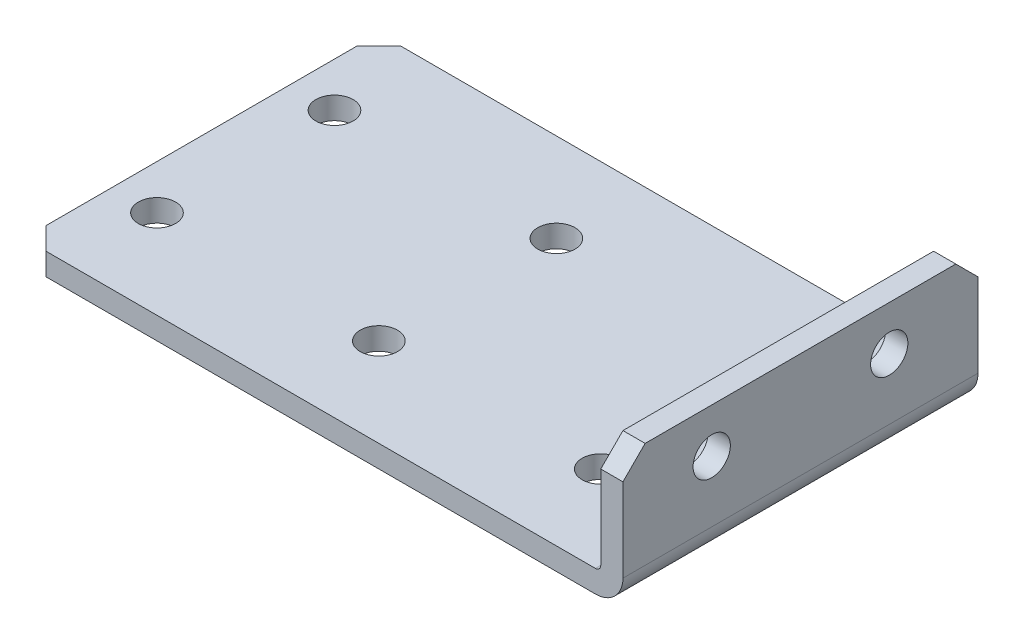
ISO-10303-21;
HEADER;
FILE_DESCRIPTION(('STEP AP214'),'2;1');
FILE_NAME('part.step','',(''),(''),'','','');
FILE_SCHEMA(('AUTOMOTIVE_DESIGN { 1 0 10303 214 1 1 1 1 }'));
ENDSEC;
DATA;
#1=APPLICATION_CONTEXT('core data for automotive mechanical design processes');
#2=APPLICATION_PROTOCOL_DEFINITION('international standard','automotive_design',2000,#1);
#3=PRODUCT_CONTEXT('',#1,'mechanical');
#4=PRODUCT('Part','Part','',(#3));
#5=PRODUCT_RELATED_PRODUCT_CATEGORY('part','',(#4));
#6=PRODUCT_DEFINITION_FORMATION('','',#4);
#7=PRODUCT_DEFINITION_CONTEXT('part definition',#1,'design');
#8=PRODUCT_DEFINITION('design','',#6,#7);
#9=PRODUCT_DEFINITION_SHAPE('','',#8);
#10=(LENGTH_UNIT() NAMED_UNIT(*) SI_UNIT(.MILLI.,.METRE.));
#11=(NAMED_UNIT(*) PLANE_ANGLE_UNIT() SI_UNIT($,.RADIAN.));
#12=(NAMED_UNIT(*) SI_UNIT($,.STERADIAN.) SOLID_ANGLE_UNIT());
#13=UNCERTAINTY_MEASURE_WITH_UNIT(LENGTH_MEASURE(1.E-05),#10,'distance_accuracy_value','');
#14=(GEOMETRIC_REPRESENTATION_CONTEXT(3) GLOBAL_UNCERTAINTY_ASSIGNED_CONTEXT((#13)) GLOBAL_UNIT_ASSIGNED_CONTEXT((#10,
#11,#12)) REPRESENTATION_CONTEXT('',''));
#15=CARTESIAN_POINT('',(0.,0.,0.));
#16=DIRECTION('',(0.,0.,1.));
#17=DIRECTION('',(1.,0.,0.));
#18=AXIS2_PLACEMENT_3D('',#15,#16,#17);
#19=CARTESIAN_POINT('',(85.7250000000001,12.7000000000001,-25.4));
#20=DIRECTION('',(-1.,0.,0.));
#21=DIRECTION('',(0.,-1.,0.));
#22=AXIS2_PLACEMENT_3D('',#19,#20,#21);
#23=CYLINDRICAL_SURFACE('',#22,2.667);
#24=CARTESIAN_POINT('',(85.7250000000001,12.7000000000001,-25.4));
#25=DIRECTION('',(-1.,0.,0.));
#26=DIRECTION('',(0.,-1.,0.));
#27=AXIS2_PLACEMENT_3D('',#24,#25,#26);
#28=CIRCLE('',#27,2.667);
#29=CARTESIAN_POINT('',(85.7250000000001,10.0330000000001,-25.4));
#30=VERTEX_POINT('',#29);
#31=EDGE_CURVE('E175',#30,#30,#28,.F.);
#32=ORIENTED_EDGE('',*,*,#31,.T.);
#33=EDGE_LOOP('',(#32));
#34=FACE_BOUND('',#33,.T.);
#35=CARTESIAN_POINT('',(82.55,12.7000000000001,-25.4));
#36=DIRECTION('',(-1.,0.,0.));
#37=DIRECTION('',(0.,-1.,0.));
#38=AXIS2_PLACEMENT_3D('',#35,#36,#37);
#39=CIRCLE('',#38,2.667);
#40=CARTESIAN_POINT('',(82.55,10.0330000000001,-25.4));
#41=VERTEX_POINT('',#40);
#42=EDGE_CURVE('E178',#41,#41,#39,.F.);
#43=ORIENTED_EDGE('',*,*,#42,.F.);
#44=EDGE_LOOP('',(#43));
#45=FACE_BOUND('',#44,.T.);
#46=ADVANCED_FACE('F14',(#34,#45),#23,.F.);
#47=CARTESIAN_POINT('',(85.7250000000001,12.7000000000001,-50.8));
#48=DIRECTION('',(-1.,0.,0.));
#49=DIRECTION('',(0.,-1.,0.));
#50=AXIS2_PLACEMENT_3D('',#47,#48,#49);
#51=CYLINDRICAL_SURFACE('',#50,2.667);
#52=CARTESIAN_POINT('',(85.7250000000001,12.7000000000001,-50.8));
#53=DIRECTION('',(-1.,0.,0.));
#54=DIRECTION('',(0.,-1.,0.));
#55=AXIS2_PLACEMENT_3D('',#52,#53,#54);
#56=CIRCLE('',#55,2.667);
#57=CARTESIAN_POINT('',(85.7250000000001,10.0330000000001,-50.8));
#58=VERTEX_POINT('',#57);
#59=EDGE_CURVE('E170',#58,#58,#56,.F.);
#60=ORIENTED_EDGE('',*,*,#59,.T.);
#61=EDGE_LOOP('',(#60));
#62=FACE_BOUND('',#61,.T.);
#63=CARTESIAN_POINT('',(82.55,12.7000000000001,-50.8));
#64=DIRECTION('',(-1.,0.,0.));
#65=DIRECTION('',(0.,-1.,0.));
#66=AXIS2_PLACEMENT_3D('',#63,#64,#65);
#67=CIRCLE('',#66,2.667);
#68=CARTESIAN_POINT('',(82.55,10.0330000000001,-50.8));
#69=VERTEX_POINT('',#68);
#70=EDGE_CURVE('E192',#69,#69,#67,.F.);
#71=ORIENTED_EDGE('',*,*,#70,.F.);
#72=EDGE_LOOP('',(#71));
#73=FACE_BOUND('',#72,.T.);
#74=ADVANCED_FACE('F244',(#62,#73),#51,.F.);
#75=CARTESIAN_POINT('',(85.7250000000001,19.05,0.));
#76=DIRECTION('',(0.,-1.,0.));
#77=DIRECTION('',(1.,0.,0.));
#78=AXIS2_PLACEMENT_3D('',#75,#76,#77);
#79=PLANE('',#78);
#80=DIRECTION('',(1.,0.,0.));
#81=VECTOR('',#80,1.);
#82=CARTESIAN_POINT('',(85.7250000000001,19.05,-60.325));
#83=LINE('',#82,#81);
#84=CARTESIAN_POINT('',(85.7250000000001,19.05,-60.325));
#85=VERTEX_POINT('',#84);
#86=CARTESIAN_POINT('',(82.5500000000001,19.05,-60.325));
#87=VERTEX_POINT('',#86);
#88=EDGE_CURVE('E187',#85,#87,#83,.F.);
#89=ORIENTED_EDGE('',*,*,#88,.T.);
#90=DIRECTION('',(0.,0.,1.));
#91=VECTOR('',#90,1.);
#92=CARTESIAN_POINT('',(82.5500000000001,19.05,0.));
#93=LINE('',#92,#91);
#94=CARTESIAN_POINT('',(82.55,19.05,-15.875));
#95=VERTEX_POINT('',#94);
#96=EDGE_CURVE('E193',#95,#87,#93,.F.);
#97=ORIENTED_EDGE('',*,*,#96,.F.);
#98=DIRECTION('',(1.,0.,0.));
#99=VECTOR('',#98,1.);
#100=CARTESIAN_POINT('',(85.7250000000001,19.05,-15.875));
#101=LINE('',#100,#99);
#102=CARTESIAN_POINT('',(85.7250000000001,19.05,-15.875));
#103=VERTEX_POINT('',#102);
#104=EDGE_CURVE('E176',#95,#103,#101,.T.);
#105=ORIENTED_EDGE('',*,*,#104,.T.);
#106=DIRECTION('',(0.,0.,1.));
#107=VECTOR('',#106,1.);
#108=CARTESIAN_POINT('',(85.7250000000001,19.05,0.));
#109=LINE('',#108,#107);
#110=EDGE_CURVE('E169',#103,#85,#109,.F.);
#111=ORIENTED_EDGE('',*,*,#110,.T.);
#112=EDGE_LOOP('',(#89,#97,#105,#111));
#113=FACE_BOUND('',#112,.T.);
#114=ADVANCED_FACE('F250',(#113),#79,.F.);
#115=CARTESIAN_POINT('',(85.7250000000001,19.05,-60.325));
#116=DIRECTION('',(0.,-0.707106781186548,0.707106781186548));
#117=DIRECTION('',(0.,-0.707106781186548,-0.707106781186548));
#118=AXIS2_PLACEMENT_3D('',#115,#116,#117);
#119=PLANE('',#118);
#120=DIRECTION('',(1.,0.,0.));
#121=VECTOR('',#120,1.);
#122=CARTESIAN_POINT('',(85.7250000000001,15.875,-63.5));
#123=LINE('',#122,#121);
#124=CARTESIAN_POINT('',(85.725,15.875,-63.5));
#125=VERTEX_POINT('',#124);
#126=CARTESIAN_POINT('',(82.55,15.875,-63.5));
#127=VERTEX_POINT('',#126);
#128=EDGE_CURVE('E109',#125,#127,#123,.F.);
#129=ORIENTED_EDGE('',*,*,#128,.T.);
#130=DIRECTION('',(0.,-0.707106781186545,-0.70710678118655));
#131=VECTOR('',#130,1.);
#132=CARTESIAN_POINT('',(82.5500000000001,19.05,-60.325));
#133=LINE('',#132,#131);
#134=EDGE_CURVE('E196',#87,#127,#133,.T.);
#135=ORIENTED_EDGE('',*,*,#134,.F.);
#136=ORIENTED_EDGE('',*,*,#88,.F.);
#137=DIRECTION('',(0.,-0.707106781186546,-0.707106781186549));
#138=VECTOR('',#137,1.);
#139=CARTESIAN_POINT('',(85.7250000000001,19.05,-60.325));
#140=LINE('',#139,#138);
#141=EDGE_CURVE('E183',#85,#125,#140,.T.);
#142=ORIENTED_EDGE('',*,*,#141,.T.);
#143=EDGE_LOOP('',(#129,#135,#136,#142));
#144=FACE_BOUND('',#143,.T.);
#145=ADVANCED_FACE('F322',(#144),#119,.F.);
#146=CARTESIAN_POINT('',(81.788,3.937,-63.5));
#147=DIRECTION('',(0.,0.,-1.));
#148=DIRECTION('',(-1.,0.,0.));
#149=AXIS2_PLACEMENT_3D('',#146,#147,#148);
#150=CYLINDRICAL_SURFACE('',#149,0.761999999999999);
#151=CARTESIAN_POINT('',(81.788,3.937,-12.7));
#152=DIRECTION('',(0.,0.,-1.));
#153=DIRECTION('',(-1.,0.,0.));
#154=AXIS2_PLACEMENT_3D('',#151,#152,#153);
#155=CIRCLE('',#154,0.761999999999999);
#156=CARTESIAN_POINT('',(82.55,3.937,-12.7));
#157=VERTEX_POINT('',#156);
#158=CARTESIAN_POINT('',(81.788,3.175,-12.7));
#159=VERTEX_POINT('',#158);
#160=EDGE_CURVE('E17',#157,#159,#155,.T.);
#161=ORIENTED_EDGE('',*,*,#160,.F.);
#162=DIRECTION('',(0.,0.,1.));
#163=VECTOR('',#162,1.);
#164=CARTESIAN_POINT('',(82.55,3.937,0.));
#165=LINE('',#164,#163);
#166=CARTESIAN_POINT('',(82.55,3.93699999999999,-63.5));
#167=VERTEX_POINT('',#166);
#168=EDGE_CURVE('E177',#167,#157,#165,.T.);
#169=ORIENTED_EDGE('',*,*,#168,.F.);
#170=CARTESIAN_POINT('',(81.788,3.937,-63.5));
#171=DIRECTION('',(0.,0.,-1.));
#172=DIRECTION('',(-1.,0.,0.));
#173=AXIS2_PLACEMENT_3D('',#170,#171,#172);
#174=CIRCLE('',#173,0.761999999999999);
#175=CARTESIAN_POINT('',(81.788,3.175,-63.5));
#176=VERTEX_POINT('',#175);
#177=EDGE_CURVE('E108',#167,#176,#174,.T.);
#178=ORIENTED_EDGE('',*,*,#177,.T.);
#179=DIRECTION('',(0.,0.,-1.));
#180=VECTOR('',#179,1.);
#181=CARTESIAN_POINT('',(81.788,3.175,-63.5));
#182=LINE('',#181,#180);
#183=EDGE_CURVE('E111',#176,#159,#182,.F.);
#184=ORIENTED_EDGE('',*,*,#183,.T.);
#185=EDGE_LOOP('',(#161,#169,#178,#184));
#186=FACE_BOUND('',#185,.T.);
#187=ADVANCED_FACE('F112',(#186),#150,.F.);
#188=CARTESIAN_POINT('',(82.5500000000001,19.05,0.));
#189=DIRECTION('',(-1.,0.,0.));
#190=DIRECTION('',(0.,-1.,0.));
#191=AXIS2_PLACEMENT_3D('',#188,#189,#190);
#192=PLANE('',#191);
#193=ORIENTED_EDGE('',*,*,#70,.T.);
#194=EDGE_LOOP('',(#193));
#195=FACE_BOUND('',#194,.T.);
#196=ORIENTED_EDGE('',*,*,#42,.T.);
#197=EDGE_LOOP('',(#196));
#198=FACE_BOUND('',#197,.T.);
#199=DIRECTION('',(0.,1.,0.));
#200=VECTOR('',#199,1.);
#201=CARTESIAN_POINT('',(82.55,0.,-12.7));
#202=LINE('',#201,#200);
#203=CARTESIAN_POINT('',(82.55,15.875,-12.7));
#204=VERTEX_POINT('',#203);
#205=EDGE_CURVE('E107',#157,#204,#202,.T.);
#206=ORIENTED_EDGE('',*,*,#205,.T.);
#207=DIRECTION('',(0.,0.707106781186549,-0.707106781186546));
#208=VECTOR('',#207,1.);
#209=CARTESIAN_POINT('',(82.55,19.05,-15.875));
#210=LINE('',#209,#208);
#211=EDGE_CURVE('E172',#204,#95,#210,.T.);
#212=ORIENTED_EDGE('',*,*,#211,.T.);
#213=ORIENTED_EDGE('',*,*,#96,.T.);
#214=ORIENTED_EDGE('',*,*,#134,.T.);
#215=DIRECTION('',(0.,-1.,0.));
#216=VECTOR('',#215,1.);
#217=CARTESIAN_POINT('',(82.5500000000001,19.05,-63.5));
#218=LINE('',#217,#216);
#219=EDGE_CURVE('E179',#127,#167,#218,.T.);
#220=ORIENTED_EDGE('',*,*,#219,.T.);
#221=ORIENTED_EDGE('',*,*,#168,.T.);
#222=EDGE_LOOP('',(#206,#212,#213,#214,#220,#221));
#223=FACE_BOUND('',#222,.T.);
#224=ADVANCED_FACE('F240',(#195,#198,#223),#192,.T.);
#225=CARTESIAN_POINT('',(85.7250000000001,19.05,-15.875));
#226=DIRECTION('',(0.,-0.707106781186546,-0.707106781186549));
#227=DIRECTION('',(0.,0.707106781186549,-0.707106781186546));
#228=AXIS2_PLACEMENT_3D('',#225,#226,#227);
#229=PLANE('',#228);
#230=DIRECTION('',(-1.,0.,0.));
#231=VECTOR('',#230,1.);
#232=CARTESIAN_POINT('',(-9.42940188980387,15.875,-12.7));
#233=LINE('',#232,#231);
#234=CARTESIAN_POINT('',(85.725,15.875,-12.7));
#235=VERTEX_POINT('',#234);
#236=EDGE_CURVE('E125',#204,#235,#233,.F.);
#237=ORIENTED_EDGE('',*,*,#236,.T.);
#238=DIRECTION('',(0.,0.707106781186549,-0.707106781186546));
#239=VECTOR('',#238,1.);
#240=CARTESIAN_POINT('',(85.725,15.875,-12.7));
#241=LINE('',#240,#239);
#242=EDGE_CURVE('E166',#235,#103,#241,.T.);
#243=ORIENTED_EDGE('',*,*,#242,.T.);
#244=ORIENTED_EDGE('',*,*,#104,.F.);
#245=ORIENTED_EDGE('',*,*,#211,.F.);
#246=EDGE_LOOP('',(#237,#243,#244,#245));
#247=FACE_BOUND('',#246,.T.);
#248=ADVANCED_FACE('F312',(#247),#229,.F.);
#249=CARTESIAN_POINT('',(85.7250000000001,19.05,0.));
#250=DIRECTION('',(-1.,0.,0.));
#251=DIRECTION('',(0.,-1.,0.));
#252=AXIS2_PLACEMENT_3D('',#249,#250,#251);
#253=PLANE('',#252);
#254=ORIENTED_EDGE('',*,*,#141,.F.);
#255=ORIENTED_EDGE('',*,*,#110,.F.);
#256=ORIENTED_EDGE('',*,*,#242,.F.);
#257=DIRECTION('',(0.,1.,0.));
#258=VECTOR('',#257,1.);
#259=CARTESIAN_POINT('',(85.725,0.,-12.7));
#260=LINE('',#259,#258);
#261=CARTESIAN_POINT('',(85.725,3.93699999999999,-12.7));
#262=VERTEX_POINT('',#261);
#263=EDGE_CURVE('E144',#235,#262,#260,.F.);
#264=ORIENTED_EDGE('',*,*,#263,.T.);
#265=DIRECTION('',(0.,0.,-1.));
#266=VECTOR('',#265,1.);
#267=CARTESIAN_POINT('',(85.725,3.93699999999999,-63.5));
#268=LINE('',#267,#266);
#269=CARTESIAN_POINT('',(85.725,3.93699999999999,-63.5));
#270=VERTEX_POINT('',#269);
#271=EDGE_CURVE('E127',#270,#262,#268,.F.);
#272=ORIENTED_EDGE('',*,*,#271,.F.);
#273=DIRECTION('',(0.,-1.,0.));
#274=VECTOR('',#273,1.);
#275=CARTESIAN_POINT('',(85.7250000000001,19.05,-63.5));
#276=LINE('',#275,#274);
#277=EDGE_CURVE('E117',#125,#270,#276,.T.);
#278=ORIENTED_EDGE('',*,*,#277,.F.);
#279=EDGE_LOOP('',(#254,#255,#256,#264,#272,#278));
#280=FACE_BOUND('',#279,.T.);
#281=ORIENTED_EDGE('',*,*,#59,.F.);
#282=EDGE_LOOP('',(#281));
#283=FACE_BOUND('',#282,.T.);
#284=ORIENTED_EDGE('',*,*,#31,.F.);
#285=EDGE_LOOP('',(#284));
#286=FACE_BOUND('',#285,.T.);
#287=ADVANCED_FACE('F309',(#280,#283,#286),#253,.F.);
#288=CARTESIAN_POINT('',(0.,3.175,-63.5));
#289=DIRECTION('',(0.,-1.,0.));
#290=DIRECTION('',(0.,0.,-1.));
#291=AXIS2_PLACEMENT_3D('',#288,#289,#290);
#292=PLANE('',#291);
#293=DIRECTION('',(0.707106781186548,0.,-0.707106781186548));
#294=VECTOR('',#293,1.);
#295=CARTESIAN_POINT('',(3.17500000000001,3.175,-63.5));
#296=LINE('',#295,#294);
#297=CARTESIAN_POINT('',(3.17500000000001,3.175,-63.5));
#298=VERTEX_POINT('',#297);
#299=CARTESIAN_POINT('',(0.,3.175,-60.325));
#300=VERTEX_POINT('',#299);
#301=EDGE_CURVE('E157',#298,#300,#296,.F.);
#302=ORIENTED_EDGE('',*,*,#301,.T.);
#303=DIRECTION('',(0.,0.,-1.));
#304=VECTOR('',#303,1.);
#305=CARTESIAN_POINT('',(0.,3.175,0.));
#306=LINE('',#305,#304);
#307=CARTESIAN_POINT('',(0.,3.175,-15.875));
#308=VERTEX_POINT('',#307);
#309=EDGE_CURVE('E116',#300,#308,#306,.F.);
#310=ORIENTED_EDGE('',*,*,#309,.T.);
#311=DIRECTION('',(-0.707106781186548,0.,-0.707106781186547));
#312=VECTOR('',#311,1.);
#313=CARTESIAN_POINT('',(3.17500000000001,3.175,-12.7));
#314=LINE('',#313,#312);
#315=CARTESIAN_POINT('',(3.17500000000001,3.175,-12.7));
#316=VERTEX_POINT('',#315);
#317=EDGE_CURVE('E122',#308,#316,#314,.F.);
#318=ORIENTED_EDGE('',*,*,#317,.T.);
#319=DIRECTION('',(-1.,0.,0.));
#320=VECTOR('',#319,1.);
#321=CARTESIAN_POINT('',(-9.42940188980387,3.175,-12.7));
#322=LINE('',#321,#320);
#323=EDGE_CURVE('E105',#316,#159,#322,.F.);
#324=ORIENTED_EDGE('',*,*,#323,.T.);
#325=ORIENTED_EDGE('',*,*,#183,.F.);
#326=DIRECTION('',(1.,0.,0.));
#327=VECTOR('',#326,1.);
#328=CARTESIAN_POINT('',(0.,3.175,-63.5));
#329=LINE('',#328,#327);
#330=EDGE_CURVE('E151',#176,#298,#329,.F.);
#331=ORIENTED_EDGE('',*,*,#330,.T.);
#332=EDGE_LOOP('',(#302,#310,#318,#324,#325,#331));
#333=FACE_BOUND('',#332,.T.);
#334=CARTESIAN_POINT('',(6.34999999999999,3.175,-50.8));
#335=DIRECTION('',(0.,1.,0.));
#336=DIRECTION('',(0.,0.,1.));
#337=AXIS2_PLACEMENT_3D('',#334,#335,#336);
#338=CIRCLE('',#337,2.667);
#339=CARTESIAN_POINT('',(6.34999999999999,3.175,-48.133));
#340=VERTEX_POINT('',#339);
#341=EDGE_CURVE('E160',#340,#340,#338,.F.);
#342=ORIENTED_EDGE('',*,*,#341,.T.);
#343=EDGE_LOOP('',(#342));
#344=FACE_BOUND('',#343,.T.);
#345=CARTESIAN_POINT('',(6.35,3.175,-25.4));
#346=DIRECTION('',(0.,1.,0.));
#347=DIRECTION('',(0.,0.,1.));
#348=AXIS2_PLACEMENT_3D('',#345,#346,#347);
#349=CIRCLE('',#348,2.667);
#350=CARTESIAN_POINT('',(6.35,3.175,-22.733));
#351=VERTEX_POINT('',#350);
#352=EDGE_CURVE('E215',#351,#351,#349,.F.);
#353=ORIENTED_EDGE('',*,*,#352,.T.);
#354=EDGE_LOOP('',(#353));
#355=FACE_BOUND('',#354,.T.);
#356=CARTESIAN_POINT('',(69.85,3.175,-50.8));
#357=DIRECTION('',(0.,1.,0.));
#358=DIRECTION('',(0.,0.,1.));
#359=AXIS2_PLACEMENT_3D('',#356,#357,#358);
#360=CIRCLE('',#359,2.667);
#361=CARTESIAN_POINT('',(69.85,3.175,-48.133));
#362=VERTEX_POINT('',#361);
#363=EDGE_CURVE('E218',#362,#362,#360,.F.);
#364=ORIENTED_EDGE('',*,*,#363,.T.);
#365=EDGE_LOOP('',(#364));
#366=FACE_BOUND('',#365,.T.);
#367=CARTESIAN_POINT('',(69.85,3.175,-25.4));
#368=DIRECTION('',(0.,1.,0.));
#369=DIRECTION('',(0.,0.,1.));
#370=AXIS2_PLACEMENT_3D('',#367,#368,#369);
#371=CIRCLE('',#370,2.667);
#372=CARTESIAN_POINT('',(69.85,3.175,-22.733));
#373=VERTEX_POINT('',#372);
#374=EDGE_CURVE('E221',#373,#373,#371,.F.);
#375=ORIENTED_EDGE('',*,*,#374,.T.);
#376=EDGE_LOOP('',(#375));
#377=FACE_BOUND('',#376,.T.);
#378=CARTESIAN_POINT('',(38.1,3.175,-50.8));
#379=DIRECTION('',(0.,1.,0.));
#380=DIRECTION('',(0.,0.,1.));
#381=AXIS2_PLACEMENT_3D('',#378,#379,#380);
#382=CIRCLE('',#381,2.667);
#383=CARTESIAN_POINT('',(38.1,3.175,-48.133));
#384=VERTEX_POINT('',#383);
#385=EDGE_CURVE('E224',#384,#384,#382,.F.);
#386=ORIENTED_EDGE('',*,*,#385,.T.);
#387=EDGE_LOOP('',(#386));
#388=FACE_BOUND('',#387,.T.);
#389=CARTESIAN_POINT('',(38.1,3.175,-25.4));
#390=DIRECTION('',(0.,1.,0.));
#391=DIRECTION('',(0.,0.,1.));
#392=AXIS2_PLACEMENT_3D('',#389,#390,#391);
#393=CIRCLE('',#392,2.667);
#394=CARTESIAN_POINT('',(38.1,3.175,-22.733));
#395=VERTEX_POINT('',#394);
#396=EDGE_CURVE('E165',#395,#395,#393,.F.);
#397=ORIENTED_EDGE('',*,*,#396,.T.);
#398=EDGE_LOOP('',(#397));
#399=FACE_BOUND('',#398,.T.);
#400=ADVANCED_FACE('F119',(#333,#344,#355,#366,#377,#388,#399),#292,.F.);
#401=CARTESIAN_POINT('',(0.,3.175,0.));
#402=DIRECTION('',(1.,0.,0.));
#403=DIRECTION('',(0.,0.,-1.));
#404=AXIS2_PLACEMENT_3D('',#401,#402,#403);
#405=PLANE('',#404);
#406=DIRECTION('',(0.,1.,0.));
#407=VECTOR('',#406,1.);
#408=CARTESIAN_POINT('',(0.,3.175,-60.325));
#409=LINE('',#408,#407);
#410=CARTESIAN_POINT('',(0.,0.,-60.325));
#411=VERTEX_POINT('',#410);
#412=EDGE_CURVE('E155',#300,#411,#409,.F.);
#413=ORIENTED_EDGE('',*,*,#412,.T.);
#414=DIRECTION('',(0.,0.,-1.));
#415=VECTOR('',#414,1.);
#416=CARTESIAN_POINT('',(0.,0.,-63.5));
#417=LINE('',#416,#415);
#418=CARTESIAN_POINT('',(0.,0.,-15.875));
#419=VERTEX_POINT('',#418);
#420=EDGE_CURVE('E154',#419,#411,#417,.T.);
#421=ORIENTED_EDGE('',*,*,#420,.F.);
#422=DIRECTION('',(0.,1.,0.));
#423=VECTOR('',#422,1.);
#424=CARTESIAN_POINT('',(0.,0.,-15.875));
#425=LINE('',#424,#423);
#426=EDGE_CURVE('E143',#419,#308,#425,.T.);
#427=ORIENTED_EDGE('',*,*,#426,.T.);
#428=ORIENTED_EDGE('',*,*,#309,.F.);
#429=EDGE_LOOP('',(#413,#421,#427,#428));
#430=FACE_BOUND('',#429,.T.);
#431=ADVANCED_FACE('F302',(#430),#405,.F.);
#432=CARTESIAN_POINT('',(3.17500000000001,3.175,-63.5));
#433=DIRECTION('',(0.707106781186548,0.,0.707106781186548));
#434=DIRECTION('',(0.707106781186548,0.,-0.707106781186548));
#435=AXIS2_PLACEMENT_3D('',#432,#433,#434);
#436=PLANE('',#435);
#437=ORIENTED_EDGE('',*,*,#412,.F.);
#438=ORIENTED_EDGE('',*,*,#301,.F.);
#439=DIRECTION('',(0.,1.,0.));
#440=VECTOR('',#439,1.);
#441=CARTESIAN_POINT('',(3.17500000000001,3.175,-63.5));
#442=LINE('',#441,#440);
#443=CARTESIAN_POINT('',(3.17500000000001,0.,-63.5));
#444=VERTEX_POINT('',#443);
#445=EDGE_CURVE('E148',#298,#444,#442,.F.);
#446=ORIENTED_EDGE('',*,*,#445,.T.);
#447=DIRECTION('',(0.707106781186547,0.,-0.707106781186548));
#448=VECTOR('',#447,1.);
#449=CARTESIAN_POINT('',(0.,0.,-60.325));
#450=LINE('',#449,#448);
#451=EDGE_CURVE('E147',#411,#444,#450,.T.);
#452=ORIENTED_EDGE('',*,*,#451,.F.);
#453=EDGE_LOOP('',(#437,#438,#446,#452));
#454=FACE_BOUND('',#453,.T.);
#455=ADVANCED_FACE('F298',(#454),#436,.F.);
#456=CARTESIAN_POINT('',(0.,3.175,-63.5));
#457=DIRECTION('',(0.,0.,1.));
#458=DIRECTION('',(1.,0.,0.));
#459=AXIS2_PLACEMENT_3D('',#456,#457,#458);
#460=PLANE('',#459);
#461=ORIENTED_EDGE('',*,*,#445,.F.);
#462=ORIENTED_EDGE('',*,*,#330,.F.);
#463=ORIENTED_EDGE('',*,*,#177,.F.);
#464=ORIENTED_EDGE('',*,*,#219,.F.);
#465=ORIENTED_EDGE('',*,*,#128,.F.);
#466=ORIENTED_EDGE('',*,*,#277,.T.);
#467=CARTESIAN_POINT('',(81.788,3.937,-63.5));
#468=DIRECTION('',(0.,0.,-1.));
#469=DIRECTION('',(-1.,0.,0.));
#470=AXIS2_PLACEMENT_3D('',#467,#468,#469);
#471=CIRCLE('',#470,3.937);
#472=CARTESIAN_POINT('',(81.788,0.,-63.5));
#473=VERTEX_POINT('',#472);
#474=EDGE_CURVE('E150',#473,#270,#471,.F.);
#475=ORIENTED_EDGE('',*,*,#474,.F.);
#476=DIRECTION('',(1.,0.,0.));
#477=VECTOR('',#476,1.);
#478=CARTESIAN_POINT('',(0.,0.,-63.5));
#479=LINE('',#478,#477);
#480=EDGE_CURVE('E135',#444,#473,#479,.T.);
#481=ORIENTED_EDGE('',*,*,#480,.F.);
#482=EDGE_LOOP('',(#461,#462,#463,#464,#465,#466,#475,#481));
#483=FACE_BOUND('',#482,.T.);
#484=ADVANCED_FACE('F294',(#483),#460,.F.);
#485=CARTESIAN_POINT('',(81.788,3.937,-63.5));
#486=DIRECTION('',(0.,0.,-1.));
#487=DIRECTION('',(-1.,0.,0.));
#488=AXIS2_PLACEMENT_3D('',#485,#486,#487);
#489=CYLINDRICAL_SURFACE('',#488,3.937);
#490=ORIENTED_EDGE('',*,*,#474,.T.);
#491=ORIENTED_EDGE('',*,*,#271,.T.);
#492=CARTESIAN_POINT('',(81.788,3.937,-12.7));
#493=DIRECTION('',(0.,0.,-1.));
#494=DIRECTION('',(-1.,0.,0.));
#495=AXIS2_PLACEMENT_3D('',#492,#493,#494);
#496=CIRCLE('',#495,3.937);
#497=CARTESIAN_POINT('',(81.788,0.,-12.7));
#498=VERTEX_POINT('',#497);
#499=EDGE_CURVE('E123',#262,#498,#496,.T.);
#500=ORIENTED_EDGE('',*,*,#499,.T.);
#501=DIRECTION('',(0.,0.,-1.));
#502=VECTOR('',#501,1.);
#503=CARTESIAN_POINT('',(81.788,0.,-63.5));
#504=LINE('',#503,#502);
#505=EDGE_CURVE('E131',#473,#498,#504,.F.);
#506=ORIENTED_EDGE('',*,*,#505,.F.);
#507=EDGE_LOOP('',(#490,#491,#500,#506));
#508=FACE_BOUND('',#507,.T.);
#509=ADVANCED_FACE('F291',(#508),#489,.T.);
#510=CARTESIAN_POINT('',(-9.42940188980387,0.,-12.7));
#511=DIRECTION('',(0.,0.,-1.));
#512=DIRECTION('',(-1.,0.,0.));
#513=AXIS2_PLACEMENT_3D('',#510,#511,#512);
#514=PLANE('',#513);
#515=ORIENTED_EDGE('',*,*,#236,.F.);
#516=ORIENTED_EDGE('',*,*,#205,.F.);
#517=ORIENTED_EDGE('',*,*,#160,.T.);
#518=ORIENTED_EDGE('',*,*,#323,.F.);
#519=DIRECTION('',(0.,1.,0.));
#520=VECTOR('',#519,1.);
#521=CARTESIAN_POINT('',(3.17500000000001,0.,-12.7));
#522=LINE('',#521,#520);
#523=CARTESIAN_POINT('',(3.17500000000001,0.,-12.7));
#524=VERTEX_POINT('',#523);
#525=EDGE_CURVE('E32',#316,#524,#522,.F.);
#526=ORIENTED_EDGE('',*,*,#525,.T.);
#527=DIRECTION('',(1.,0.,0.));
#528=VECTOR('',#527,1.);
#529=CARTESIAN_POINT('',(0.,0.,-12.7));
#530=LINE('',#529,#528);
#531=EDGE_CURVE('E134',#498,#524,#530,.F.);
#532=ORIENTED_EDGE('',*,*,#531,.F.);
#533=ORIENTED_EDGE('',*,*,#499,.F.);
#534=ORIENTED_EDGE('',*,*,#263,.F.);
#535=EDGE_LOOP('',(#515,#516,#517,#518,#526,#532,#533,#534));
#536=FACE_BOUND('',#535,.T.);
#537=ADVANCED_FACE('F103',(#536),#514,.F.);
#538=CARTESIAN_POINT('',(3.17500000000001,0.,-12.7));
#539=DIRECTION('',(0.707106781186547,0.,-0.707106781186548));
#540=DIRECTION('',(-0.707106781186548,0.,-0.707106781186547));
#541=AXIS2_PLACEMENT_3D('',#538,#539,#540);
#542=PLANE('',#541);
#543=ORIENTED_EDGE('',*,*,#426,.F.);
#544=DIRECTION('',(-0.707106781186547,0.,-0.707106781186548));
#545=VECTOR('',#544,1.);
#546=CARTESIAN_POINT('',(3.17500000000001,0.,-12.7));
#547=LINE('',#546,#545);
#548=EDGE_CURVE('E138',#524,#419,#547,.T.);
#549=ORIENTED_EDGE('',*,*,#548,.F.);
#550=ORIENTED_EDGE('',*,*,#525,.F.);
#551=ORIENTED_EDGE('',*,*,#317,.F.);
#552=EDGE_LOOP('',(#543,#549,#550,#551));
#553=FACE_BOUND('',#552,.T.);
#554=ADVANCED_FACE('F284',(#553),#542,.F.);
#555=CARTESIAN_POINT('',(38.1,0.,-25.4));
#556=DIRECTION('',(0.,1.,0.));
#557=DIRECTION('',(0.,0.,1.));
#558=AXIS2_PLACEMENT_3D('',#555,#556,#557);
#559=CYLINDRICAL_SURFACE('',#558,2.667);
#560=ORIENTED_EDGE('',*,*,#396,.F.);
#561=EDGE_LOOP('',(#560));
#562=FACE_BOUND('',#561,.T.);
#563=CARTESIAN_POINT('',(38.1,0.,-25.4));
#564=DIRECTION('',(0.,1.,0.));
#565=DIRECTION('',(0.,0.,1.));
#566=AXIS2_PLACEMENT_3D('',#563,#564,#565);
#567=CIRCLE('',#566,2.667);
#568=CARTESIAN_POINT('',(38.1,0.,-22.733));
#569=VERTEX_POINT('',#568);
#570=EDGE_CURVE('E141',#569,#569,#567,.T.);
#571=ORIENTED_EDGE('',*,*,#570,.F.);
#572=EDGE_LOOP('',(#571));
#573=FACE_BOUND('',#572,.T.);
#574=ADVANCED_FACE('F280',(#562,#573),#559,.F.);
#575=CARTESIAN_POINT('',(38.1,0.,-50.8));
#576=DIRECTION('',(0.,1.,0.));
#577=DIRECTION('',(0.,0.,1.));
#578=AXIS2_PLACEMENT_3D('',#575,#576,#577);
#579=CYLINDRICAL_SURFACE('',#578,2.667);
#580=ORIENTED_EDGE('',*,*,#385,.F.);
#581=EDGE_LOOP('',(#580));
#582=FACE_BOUND('',#581,.T.);
#583=CARTESIAN_POINT('',(38.1,0.,-50.8));
#584=DIRECTION('',(0.,1.,0.));
#585=DIRECTION('',(0.,0.,1.));
#586=AXIS2_PLACEMENT_3D('',#583,#584,#585);
#587=CIRCLE('',#586,2.667);
#588=CARTESIAN_POINT('',(38.1,0.,-48.133));
#589=VERTEX_POINT('',#588);
#590=EDGE_CURVE('E208',#589,#589,#587,.T.);
#591=ORIENTED_EDGE('',*,*,#590,.F.);
#592=EDGE_LOOP('',(#591));
#593=FACE_BOUND('',#592,.T.);
#594=ADVANCED_FACE('F276',(#582,#593),#579,.F.);
#595=CARTESIAN_POINT('',(69.85,0.,-25.4));
#596=DIRECTION('',(0.,1.,0.));
#597=DIRECTION('',(0.,0.,1.));
#598=AXIS2_PLACEMENT_3D('',#595,#596,#597);
#599=CYLINDRICAL_SURFACE('',#598,2.667);
#600=ORIENTED_EDGE('',*,*,#374,.F.);
#601=EDGE_LOOP('',(#600));
#602=FACE_BOUND('',#601,.T.);
#603=CARTESIAN_POINT('',(69.85,0.,-25.4));
#604=DIRECTION('',(0.,1.,0.));
#605=DIRECTION('',(0.,0.,1.));
#606=AXIS2_PLACEMENT_3D('',#603,#604,#605);
#607=CIRCLE('',#606,2.667);
#608=CARTESIAN_POINT('',(69.85,0.,-22.733));
#609=VERTEX_POINT('',#608);
#610=EDGE_CURVE('E205',#609,#609,#607,.T.);
#611=ORIENTED_EDGE('',*,*,#610,.F.);
#612=EDGE_LOOP('',(#611));
#613=FACE_BOUND('',#612,.T.);
#614=ADVANCED_FACE('F272',(#602,#613),#599,.F.);
#615=CARTESIAN_POINT('',(69.85,0.,-50.8));
#616=DIRECTION('',(0.,1.,0.));
#617=DIRECTION('',(0.,0.,1.));
#618=AXIS2_PLACEMENT_3D('',#615,#616,#617);
#619=CYLINDRICAL_SURFACE('',#618,2.667);
#620=ORIENTED_EDGE('',*,*,#363,.F.);
#621=EDGE_LOOP('',(#620));
#622=FACE_BOUND('',#621,.T.);
#623=CARTESIAN_POINT('',(69.85,0.,-50.8));
#624=DIRECTION('',(0.,1.,0.));
#625=DIRECTION('',(0.,0.,1.));
#626=AXIS2_PLACEMENT_3D('',#623,#624,#625);
#627=CIRCLE('',#626,2.667);
#628=CARTESIAN_POINT('',(69.85,0.,-48.133));
#629=VERTEX_POINT('',#628);
#630=EDGE_CURVE('E202',#629,#629,#627,.T.);
#631=ORIENTED_EDGE('',*,*,#630,.F.);
#632=EDGE_LOOP('',(#631));
#633=FACE_BOUND('',#632,.T.);
#634=ADVANCED_FACE('F268',(#622,#633),#619,.F.);
#635=CARTESIAN_POINT('',(6.35,0.,-25.4));
#636=DIRECTION('',(0.,1.,0.));
#637=DIRECTION('',(0.,0.,1.));
#638=AXIS2_PLACEMENT_3D('',#635,#636,#637);
#639=CYLINDRICAL_SURFACE('',#638,2.667);
#640=ORIENTED_EDGE('',*,*,#352,.F.);
#641=EDGE_LOOP('',(#640));
#642=FACE_BOUND('',#641,.T.);
#643=CARTESIAN_POINT('',(6.35,0.,-25.4));
#644=DIRECTION('',(0.,1.,0.));
#645=DIRECTION('',(0.,0.,1.));
#646=AXIS2_PLACEMENT_3D('',#643,#644,#645);
#647=CIRCLE('',#646,2.667);
#648=CARTESIAN_POINT('',(6.35,0.,-22.733));
#649=VERTEX_POINT('',#648);
#650=EDGE_CURVE('E23',#649,#649,#647,.T.);
#651=ORIENTED_EDGE('',*,*,#650,.F.);
#652=EDGE_LOOP('',(#651));
#653=FACE_BOUND('',#652,.T.);
#654=ADVANCED_FACE('F261',(#642,#653),#639,.F.);
#655=CARTESIAN_POINT('',(6.34999999999999,0.,-50.8));
#656=DIRECTION('',(0.,1.,0.));
#657=DIRECTION('',(0.,0.,1.));
#658=AXIS2_PLACEMENT_3D('',#655,#656,#657);
#659=CYLINDRICAL_SURFACE('',#658,2.667);
#660=ORIENTED_EDGE('',*,*,#341,.F.);
#661=EDGE_LOOP('',(#660));
#662=FACE_BOUND('',#661,.T.);
#663=CARTESIAN_POINT('',(6.34999999999999,0.,-50.8));
#664=DIRECTION('',(0.,1.,0.));
#665=DIRECTION('',(0.,0.,1.));
#666=AXIS2_PLACEMENT_3D('',#663,#664,#665);
#667=CIRCLE('',#666,2.667);
#668=CARTESIAN_POINT('',(6.34999999999999,0.,-48.133));
#669=VERTEX_POINT('',#668);
#670=EDGE_CURVE('E9',#669,#669,#667,.T.);
#671=ORIENTED_EDGE('',*,*,#670,.F.);
#672=EDGE_LOOP('',(#671));
#673=FACE_BOUND('',#672,.T.);
#674=ADVANCED_FACE('F254',(#662,#673),#659,.F.);
#675=CARTESIAN_POINT('',(0.,0.,-63.5));
#676=DIRECTION('',(0.,-1.,0.));
#677=DIRECTION('',(0.,0.,-1.));
#678=AXIS2_PLACEMENT_3D('',#675,#676,#677);
#679=PLANE('',#678);
#680=ORIENTED_EDGE('',*,*,#670,.T.);
#681=EDGE_LOOP('',(#680));
#682=FACE_BOUND('',#681,.T.);
#683=ORIENTED_EDGE('',*,*,#650,.T.);
#684=EDGE_LOOP('',(#683));
#685=FACE_BOUND('',#684,.T.);
#686=ORIENTED_EDGE('',*,*,#630,.T.);
#687=EDGE_LOOP('',(#686));
#688=FACE_BOUND('',#687,.T.);
#689=ORIENTED_EDGE('',*,*,#610,.T.);
#690=EDGE_LOOP('',(#689));
#691=FACE_BOUND('',#690,.T.);
#692=ORIENTED_EDGE('',*,*,#590,.T.);
#693=EDGE_LOOP('',(#692));
#694=FACE_BOUND('',#693,.T.);
#695=ORIENTED_EDGE('',*,*,#570,.T.);
#696=EDGE_LOOP('',(#695));
#697=FACE_BOUND('',#696,.T.);
#698=ORIENTED_EDGE('',*,*,#531,.T.);
#699=ORIENTED_EDGE('',*,*,#548,.T.);
#700=ORIENTED_EDGE('',*,*,#420,.T.);
#701=ORIENTED_EDGE('',*,*,#451,.T.);
#702=ORIENTED_EDGE('',*,*,#480,.T.);
#703=ORIENTED_EDGE('',*,*,#505,.T.);
#704=EDGE_LOOP('',(#698,#699,#700,#701,#702,#703));
#705=FACE_BOUND('',#704,.T.);
#706=ADVANCED_FACE('F252',(#682,#685,#688,#691,#694,#697,#705),#679,.T.);
#707=CLOSED_SHELL('',(#46,#74,#114,#145,#187,#224,#248,#287,#400,#431,#455,#484,#509,#537,#554,
#574,#594,#614,#634,#654,#674,#706));
#708=MANIFOLD_SOLID_BREP('B1',#707);
#709=ADVANCED_BREP_SHAPE_REPRESENTATION('',(#18,#708),#14);
#710=SHAPE_DEFINITION_REPRESENTATION(#9,#709);
ENDSEC;
END-ISO-10303-21;
